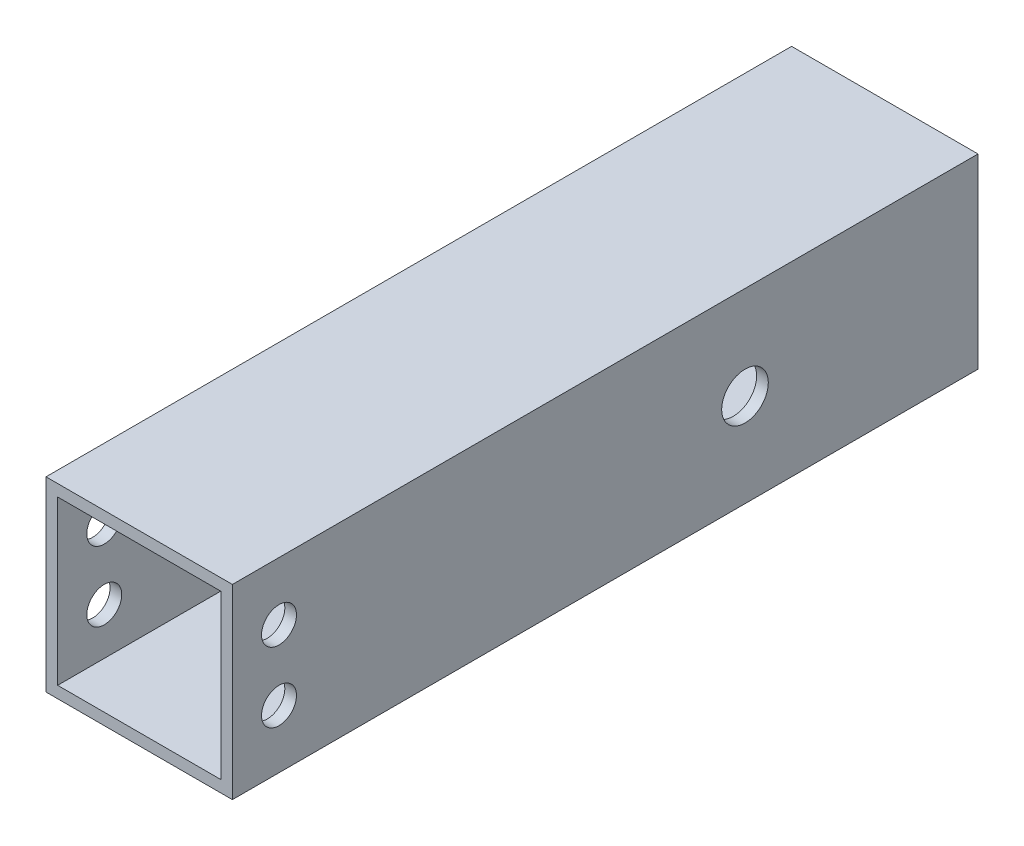
ISO-10303-21;
HEADER;
FILE_DESCRIPTION(('STEP AP214'),'2;1');
FILE_NAME('part.step','',(''),(''),'','','');
FILE_SCHEMA(('AUTOMOTIVE_DESIGN { 1 0 10303 214 1 1 1 1 }'));
ENDSEC;
DATA;
#1=APPLICATION_CONTEXT('core data for automotive mechanical design processes');
#2=APPLICATION_PROTOCOL_DEFINITION('international standard','automotive_design',2000,#1);
#3=PRODUCT_CONTEXT('',#1,'mechanical');
#4=PRODUCT('Part','Part','',(#3));
#5=PRODUCT_RELATED_PRODUCT_CATEGORY('part','',(#4));
#6=PRODUCT_DEFINITION_FORMATION('','',#4);
#7=PRODUCT_DEFINITION_CONTEXT('part definition',#1,'design');
#8=PRODUCT_DEFINITION('design','',#6,#7);
#9=PRODUCT_DEFINITION_SHAPE('','',#8);
#10=(LENGTH_UNIT() NAMED_UNIT(*) SI_UNIT(.MILLI.,.METRE.));
#11=(NAMED_UNIT(*) PLANE_ANGLE_UNIT() SI_UNIT($,.RADIAN.));
#12=(NAMED_UNIT(*) SI_UNIT($,.STERADIAN.) SOLID_ANGLE_UNIT());
#13=UNCERTAINTY_MEASURE_WITH_UNIT(LENGTH_MEASURE(1.E-05),#10,'distance_accuracy_value','');
#14=(GEOMETRIC_REPRESENTATION_CONTEXT(3) GLOBAL_UNCERTAINTY_ASSIGNED_CONTEXT((#13)) GLOBAL_UNIT_ASSIGNED_CONTEXT((#10,
#11,#12)) REPRESENTATION_CONTEXT('',''));
#15=CARTESIAN_POINT('',(0.,0.,0.));
#16=DIRECTION('',(0.,0.,1.));
#17=DIRECTION('',(1.,0.,0.));
#18=AXIS2_PLACEMENT_3D('',#15,#16,#17);
#19=CARTESIAN_POINT('',(0.,0.,101.6));
#20=DIRECTION('',(0.,0.,-1.));
#21=DIRECTION('',(-1.,0.,0.));
#22=AXIS2_PLACEMENT_3D('',#19,#20,#21);
#23=PLANE('',#22);
#24=DIRECTION('',(0.,1.,0.));
#25=VECTOR('',#24,1.);
#26=CARTESIAN_POINT('',(12.7,-12.7,101.6));
#27=LINE('',#26,#25);
#28=CARTESIAN_POINT('',(12.7,-12.7,101.6));
#29=VERTEX_POINT('',#28);
#30=CARTESIAN_POINT('',(12.7,12.7,101.6));
#31=VERTEX_POINT('',#30);
#32=EDGE_CURVE('E141',#29,#31,#27,.T.);
#33=ORIENTED_EDGE('',*,*,#32,.T.);
#34=DIRECTION('',(-1.,0.,0.));
#35=VECTOR('',#34,1.);
#36=CARTESIAN_POINT('',(-12.7,12.7,101.6));
#37=LINE('',#36,#35);
#38=CARTESIAN_POINT('',(-12.7,12.7,101.6));
#39=VERTEX_POINT('',#38);
#40=EDGE_CURVE('E144',#31,#39,#37,.T.);
#41=ORIENTED_EDGE('',*,*,#40,.T.);
#42=DIRECTION('',(0.,-1.,0.));
#43=VECTOR('',#42,1.);
#44=CARTESIAN_POINT('',(-12.7,-12.7,101.6));
#45=LINE('',#44,#43);
#46=CARTESIAN_POINT('',(-12.7,-12.7,101.6));
#47=VERTEX_POINT('',#46);
#48=EDGE_CURVE('E147',#39,#47,#45,.T.);
#49=ORIENTED_EDGE('',*,*,#48,.T.);
#50=DIRECTION('',(1.,0.,0.));
#51=VECTOR('',#50,1.);
#52=CARTESIAN_POINT('',(-12.7,-12.7,101.6));
#53=LINE('',#52,#51);
#54=EDGE_CURVE('E149',#47,#29,#53,.T.);
#55=ORIENTED_EDGE('',*,*,#54,.T.);
#56=EDGE_LOOP('',(#33,#41,#49,#55));
#57=FACE_BOUND('',#56,.T.);
#58=DIRECTION('',(0.,1.,0.));
#59=VECTOR('',#58,1.);
#60=CARTESIAN_POINT('',(11.1125,-11.1125,101.6));
#61=LINE('',#60,#59);
#62=CARTESIAN_POINT('',(11.1125,-11.1125,101.6));
#63=VERTEX_POINT('',#62);
#64=CARTESIAN_POINT('',(11.1125,11.1125,101.6));
#65=VERTEX_POINT('',#64);
#66=EDGE_CURVE('E103',#63,#65,#61,.T.);
#67=ORIENTED_EDGE('',*,*,#66,.F.);
#68=DIRECTION('',(1.,0.,0.));
#69=VECTOR('',#68,1.);
#70=CARTESIAN_POINT('',(-11.1125,-11.1125,101.6));
#71=LINE('',#70,#69);
#72=CARTESIAN_POINT('',(-11.1125,-11.1125,101.6));
#73=VERTEX_POINT('',#72);
#74=EDGE_CURVE('E125',#73,#63,#71,.T.);
#75=ORIENTED_EDGE('',*,*,#74,.F.);
#76=DIRECTION('',(0.,-1.,0.));
#77=VECTOR('',#76,1.);
#78=CARTESIAN_POINT('',(-11.1125,-11.1125,101.6));
#79=LINE('',#78,#77);
#80=CARTESIAN_POINT('',(-11.1125,11.1125,101.6));
#81=VERTEX_POINT('',#80);
#82=EDGE_CURVE('E123',#81,#73,#79,.T.);
#83=ORIENTED_EDGE('',*,*,#82,.F.);
#84=DIRECTION('',(-1.,0.,0.));
#85=VECTOR('',#84,1.);
#86=CARTESIAN_POINT('',(-11.1125,11.1125,101.6));
#87=LINE('',#86,#85);
#88=EDGE_CURVE('E111',#65,#81,#87,.T.);
#89=ORIENTED_EDGE('',*,*,#88,.F.);
#90=EDGE_LOOP('',(#67,#75,#83,#89));
#91=FACE_BOUND('',#90,.T.);
#92=ADVANCED_FACE('F36',(#57,#91),#23,.F.);
#93=CARTESIAN_POINT('',(0.,0.,0.));
#94=DIRECTION('',(0.,0.,-1.));
#95=DIRECTION('',(-1.,0.,0.));
#96=AXIS2_PLACEMENT_3D('',#93,#94,#95);
#97=PLANE('',#96);
#98=DIRECTION('',(0.,1.,0.));
#99=VECTOR('',#98,1.);
#100=CARTESIAN_POINT('',(12.7,-12.7,0.));
#101=LINE('',#100,#99);
#102=CARTESIAN_POINT('',(12.7,-12.7,0.));
#103=VERTEX_POINT('',#102);
#104=CARTESIAN_POINT('',(12.7,12.7,0.));
#105=VERTEX_POINT('',#104);
#106=EDGE_CURVE('E119',#103,#105,#101,.T.);
#107=ORIENTED_EDGE('',*,*,#106,.F.);
#108=DIRECTION('',(1.,0.,0.));
#109=VECTOR('',#108,1.);
#110=CARTESIAN_POINT('',(-12.7,-12.7,0.));
#111=LINE('',#110,#109);
#112=CARTESIAN_POINT('',(-12.7,-12.7,0.));
#113=VERTEX_POINT('',#112);
#114=EDGE_CURVE('E145',#113,#103,#111,.T.);
#115=ORIENTED_EDGE('',*,*,#114,.F.);
#116=DIRECTION('',(0.,-1.,0.));
#117=VECTOR('',#116,1.);
#118=CARTESIAN_POINT('',(-12.7,-12.7,0.));
#119=LINE('',#118,#117);
#120=CARTESIAN_POINT('',(-12.7,12.7,0.));
#121=VERTEX_POINT('',#120);
#122=EDGE_CURVE('E156',#121,#113,#119,.T.);
#123=ORIENTED_EDGE('',*,*,#122,.F.);
#124=DIRECTION('',(-1.,0.,0.));
#125=VECTOR('',#124,1.);
#126=CARTESIAN_POINT('',(-12.7,12.7,0.));
#127=LINE('',#126,#125);
#128=EDGE_CURVE('E154',#105,#121,#127,.T.);
#129=ORIENTED_EDGE('',*,*,#128,.F.);
#130=EDGE_LOOP('',(#107,#115,#123,#129));
#131=FACE_BOUND('',#130,.T.);
#132=DIRECTION('',(1.,0.,0.));
#133=VECTOR('',#132,1.);
#134=CARTESIAN_POINT('',(-11.1125,-11.1125,0.));
#135=LINE('',#134,#133);
#136=CARTESIAN_POINT('',(-11.1125,-11.1125,0.));
#137=VERTEX_POINT('',#136);
#138=CARTESIAN_POINT('',(11.1125,-11.1125,0.));
#139=VERTEX_POINT('',#138);
#140=EDGE_CURVE('E112',#137,#139,#135,.T.);
#141=ORIENTED_EDGE('',*,*,#140,.T.);
#142=DIRECTION('',(0.,1.,0.));
#143=VECTOR('',#142,1.);
#144=CARTESIAN_POINT('',(11.1125,-11.1125,0.));
#145=LINE('',#144,#143);
#146=CARTESIAN_POINT('',(11.1125,11.1125,0.));
#147=VERTEX_POINT('',#146);
#148=EDGE_CURVE('E61',#139,#147,#145,.T.);
#149=ORIENTED_EDGE('',*,*,#148,.T.);
#150=DIRECTION('',(-1.,0.,0.));
#151=VECTOR('',#150,1.);
#152=CARTESIAN_POINT('',(-11.1125,11.1125,0.));
#153=LINE('',#152,#151);
#154=CARTESIAN_POINT('',(-11.1125,11.1125,0.));
#155=VERTEX_POINT('',#154);
#156=EDGE_CURVE('E118',#147,#155,#153,.T.);
#157=ORIENTED_EDGE('',*,*,#156,.T.);
#158=DIRECTION('',(0.,-1.,0.));
#159=VECTOR('',#158,1.);
#160=CARTESIAN_POINT('',(-11.1125,-11.1125,0.));
#161=LINE('',#160,#159);
#162=EDGE_CURVE('E133',#155,#137,#161,.T.);
#163=ORIENTED_EDGE('',*,*,#162,.T.);
#164=EDGE_LOOP('',(#141,#149,#157,#163));
#165=FACE_BOUND('',#164,.T.);
#166=ADVANCED_FACE('F202',(#131,#165),#97,.T.);
#167=CARTESIAN_POINT('',(12.7,-12.7,101.6));
#168=DIRECTION('',(-1.,0.,0.));
#169=DIRECTION('',(0.,0.,1.));
#170=AXIS2_PLACEMENT_3D('',#167,#168,#169);
#171=PLANE('',#170);
#172=CARTESIAN_POINT('',(12.7,0.,31.75));
#173=DIRECTION('',(1.,0.,0.));
#174=DIRECTION('',(0.,0.,-1.));
#175=AXIS2_PLACEMENT_3D('',#172,#173,#174);
#176=CIRCLE('',#175,3.175);
#177=CARTESIAN_POINT('',(12.7,0.,28.575));
#178=VERTEX_POINT('',#177);
#179=EDGE_CURVE('E255',#178,#178,#176,.T.);
#180=ORIENTED_EDGE('',*,*,#179,.F.);
#181=EDGE_LOOP('',(#180));
#182=FACE_BOUND('',#181,.T.);
#183=CARTESIAN_POINT('',(12.7,-4.7625,95.25));
#184=DIRECTION('',(1.,0.,0.));
#185=DIRECTION('',(0.,0.,-1.));
#186=AXIS2_PLACEMENT_3D('',#183,#184,#185);
#187=CIRCLE('',#186,2.38125000000001);
#188=CARTESIAN_POINT('',(12.7,-4.7625,92.86875));
#189=VERTEX_POINT('',#188);
#190=EDGE_CURVE('E259',#189,#189,#187,.T.);
#191=ORIENTED_EDGE('',*,*,#190,.F.);
#192=EDGE_LOOP('',(#191));
#193=FACE_BOUND('',#192,.T.);
#194=CARTESIAN_POINT('',(12.7,4.7625,95.25));
#195=DIRECTION('',(1.,0.,0.));
#196=DIRECTION('',(0.,0.,-1.));
#197=AXIS2_PLACEMENT_3D('',#194,#195,#196);
#198=CIRCLE('',#197,2.38125000000001);
#199=CARTESIAN_POINT('',(12.7,4.7625,92.86875));
#200=VERTEX_POINT('',#199);
#201=EDGE_CURVE('E262',#200,#200,#198,.T.);
#202=ORIENTED_EDGE('',*,*,#201,.F.);
#203=EDGE_LOOP('',(#202));
#204=FACE_BOUND('',#203,.T.);
#205=ORIENTED_EDGE('',*,*,#106,.T.);
#206=DIRECTION('',(0.,0.,-1.));
#207=VECTOR('',#206,1.);
#208=CARTESIAN_POINT('',(12.7,12.7,101.6));
#209=LINE('',#208,#207);
#210=EDGE_CURVE('E11',#31,#105,#209,.T.);
#211=ORIENTED_EDGE('',*,*,#210,.F.);
#212=ORIENTED_EDGE('',*,*,#32,.F.);
#213=DIRECTION('',(0.,0.,-1.));
#214=VECTOR('',#213,1.);
#215=CARTESIAN_POINT('',(12.7,-12.7,101.6));
#216=LINE('',#215,#214);
#217=EDGE_CURVE('E151',#29,#103,#216,.T.);
#218=ORIENTED_EDGE('',*,*,#217,.T.);
#219=EDGE_LOOP('',(#205,#211,#212,#218));
#220=FACE_BOUND('',#219,.T.);
#221=ADVANCED_FACE('F38',(#182,#193,#204,#220),#171,.F.);
#222=CARTESIAN_POINT('',(-12.7,12.7,101.6));
#223=DIRECTION('',(0.,-1.,0.));
#224=DIRECTION('',(0.,0.,-1.));
#225=AXIS2_PLACEMENT_3D('',#222,#223,#224);
#226=PLANE('',#225);
#227=ORIENTED_EDGE('',*,*,#128,.T.);
#228=DIRECTION('',(0.,0.,-1.));
#229=VECTOR('',#228,1.);
#230=CARTESIAN_POINT('',(-12.7,12.7,101.6));
#231=LINE('',#230,#229);
#232=EDGE_CURVE('E45',#39,#121,#231,.T.);
#233=ORIENTED_EDGE('',*,*,#232,.F.);
#234=ORIENTED_EDGE('',*,*,#40,.F.);
#235=ORIENTED_EDGE('',*,*,#210,.T.);
#236=EDGE_LOOP('',(#227,#233,#234,#235));
#237=FACE_BOUND('',#236,.T.);
#238=ADVANCED_FACE('F230',(#237),#226,.F.);
#239=CARTESIAN_POINT('',(-12.7,-12.7,101.6));
#240=DIRECTION('',(1.,0.,0.));
#241=DIRECTION('',(0.,0.,-1.));
#242=AXIS2_PLACEMENT_3D('',#239,#240,#241);
#243=PLANE('',#242);
#244=CARTESIAN_POINT('',(-12.7,0.,31.75));
#245=DIRECTION('',(1.,0.,0.));
#246=DIRECTION('',(0.,0.,-1.));
#247=AXIS2_PLACEMENT_3D('',#244,#245,#246);
#248=CIRCLE('',#247,3.175);
#249=CARTESIAN_POINT('',(-12.7,0.,28.575));
#250=VERTEX_POINT('',#249);
#251=EDGE_CURVE('E269',#250,#250,#248,.F.);
#252=ORIENTED_EDGE('',*,*,#251,.F.);
#253=EDGE_LOOP('',(#252));
#254=FACE_BOUND('',#253,.T.);
#255=CARTESIAN_POINT('',(-12.7,-4.7625,95.25));
#256=DIRECTION('',(1.,0.,0.));
#257=DIRECTION('',(0.,0.,-1.));
#258=AXIS2_PLACEMENT_3D('',#255,#256,#257);
#259=CIRCLE('',#258,2.38125000000001);
#260=CARTESIAN_POINT('',(-12.7,-4.7625,92.86875));
#261=VERTEX_POINT('',#260);
#262=EDGE_CURVE('E264',#261,#261,#259,.F.);
#263=ORIENTED_EDGE('',*,*,#262,.F.);
#264=EDGE_LOOP('',(#263));
#265=FACE_BOUND('',#264,.T.);
#266=CARTESIAN_POINT('',(-12.7,4.7625,95.25));
#267=DIRECTION('',(1.,0.,0.));
#268=DIRECTION('',(0.,0.,-1.));
#269=AXIS2_PLACEMENT_3D('',#266,#267,#268);
#270=CIRCLE('',#269,2.38125000000001);
#271=CARTESIAN_POINT('',(-12.7,4.7625,92.86875));
#272=VERTEX_POINT('',#271);
#273=EDGE_CURVE('E169',#272,#272,#270,.F.);
#274=ORIENTED_EDGE('',*,*,#273,.F.);
#275=EDGE_LOOP('',(#274));
#276=FACE_BOUND('',#275,.T.);
#277=ORIENTED_EDGE('',*,*,#122,.T.);
#278=DIRECTION('',(0.,0.,-1.));
#279=VECTOR('',#278,1.);
#280=CARTESIAN_POINT('',(-12.7,-12.7,101.6));
#281=LINE('',#280,#279);
#282=EDGE_CURVE('E161',#47,#113,#281,.T.);
#283=ORIENTED_EDGE('',*,*,#282,.F.);
#284=ORIENTED_EDGE('',*,*,#48,.F.);
#285=ORIENTED_EDGE('',*,*,#232,.T.);
#286=EDGE_LOOP('',(#277,#283,#284,#285));
#287=FACE_BOUND('',#286,.T.);
#288=ADVANCED_FACE('F227',(#254,#265,#276,#287),#243,.F.);
#289=CARTESIAN_POINT('',(-12.7,-12.7,101.6));
#290=DIRECTION('',(0.,1.,0.));
#291=DIRECTION('',(0.,0.,1.));
#292=AXIS2_PLACEMENT_3D('',#289,#290,#291);
#293=PLANE('',#292);
#294=ORIENTED_EDGE('',*,*,#114,.T.);
#295=ORIENTED_EDGE('',*,*,#217,.F.);
#296=ORIENTED_EDGE('',*,*,#54,.F.);
#297=ORIENTED_EDGE('',*,*,#282,.T.);
#298=EDGE_LOOP('',(#294,#295,#296,#297));
#299=FACE_BOUND('',#298,.T.);
#300=ADVANCED_FACE('F224',(#299),#293,.F.);
#301=CARTESIAN_POINT('',(11.1125,-11.1125,101.6));
#302=DIRECTION('',(-1.,0.,0.));
#303=DIRECTION('',(0.,0.,1.));
#304=AXIS2_PLACEMENT_3D('',#301,#302,#303);
#305=PLANE('',#304);
#306=CARTESIAN_POINT('',(11.1125,0.,31.75));
#307=DIRECTION('',(-1.,0.,0.));
#308=DIRECTION('',(0.,0.,1.));
#309=AXIS2_PLACEMENT_3D('',#306,#307,#308);
#310=CIRCLE('',#309,3.175);
#311=CARTESIAN_POINT('',(11.1125,0.,34.925));
#312=VERTEX_POINT('',#311);
#313=EDGE_CURVE('E131',#312,#312,#310,.T.);
#314=ORIENTED_EDGE('',*,*,#313,.F.);
#315=EDGE_LOOP('',(#314));
#316=FACE_BOUND('',#315,.T.);
#317=CARTESIAN_POINT('',(11.1125,-4.7625,95.25));
#318=DIRECTION('',(-1.,0.,0.));
#319=DIRECTION('',(0.,0.,1.));
#320=AXIS2_PLACEMENT_3D('',#317,#318,#319);
#321=CIRCLE('',#320,2.38125000000001);
#322=CARTESIAN_POINT('',(11.1125,-4.7625,97.63125));
#323=VERTEX_POINT('',#322);
#324=EDGE_CURVE('E172',#323,#323,#321,.T.);
#325=ORIENTED_EDGE('',*,*,#324,.F.);
#326=EDGE_LOOP('',(#325));
#327=FACE_BOUND('',#326,.T.);
#328=CARTESIAN_POINT('',(11.1125,4.7625,95.25));
#329=DIRECTION('',(-1.,0.,0.));
#330=DIRECTION('',(0.,0.,1.));
#331=AXIS2_PLACEMENT_3D('',#328,#329,#330);
#332=CIRCLE('',#331,2.38125000000001);
#333=CARTESIAN_POINT('',(11.1125,4.7625,97.63125));
#334=VERTEX_POINT('',#333);
#335=EDGE_CURVE('E168',#334,#334,#332,.T.);
#336=ORIENTED_EDGE('',*,*,#335,.F.);
#337=EDGE_LOOP('',(#336));
#338=FACE_BOUND('',#337,.T.);
#339=ORIENTED_EDGE('',*,*,#148,.F.);
#340=DIRECTION('',(0.,0.,-1.));
#341=VECTOR('',#340,1.);
#342=CARTESIAN_POINT('',(11.1125,-11.1125,101.6));
#343=LINE('',#342,#341);
#344=EDGE_CURVE('E107',#63,#139,#343,.T.);
#345=ORIENTED_EDGE('',*,*,#344,.F.);
#346=ORIENTED_EDGE('',*,*,#66,.T.);
#347=DIRECTION('',(0.,0.,-1.));
#348=VECTOR('',#347,1.);
#349=CARTESIAN_POINT('',(11.1125,11.1125,101.6));
#350=LINE('',#349,#348);
#351=EDGE_CURVE('E106',#65,#147,#350,.T.);
#352=ORIENTED_EDGE('',*,*,#351,.T.);
#353=EDGE_LOOP('',(#339,#345,#346,#352));
#354=FACE_BOUND('',#353,.T.);
#355=ADVANCED_FACE('F105',(#316,#327,#338,#354),#305,.T.);
#356=CARTESIAN_POINT('',(-11.1125,11.1125,101.6));
#357=DIRECTION('',(0.,-1.,0.));
#358=DIRECTION('',(0.,0.,-1.));
#359=AXIS2_PLACEMENT_3D('',#356,#357,#358);
#360=PLANE('',#359);
#361=ORIENTED_EDGE('',*,*,#156,.F.);
#362=ORIENTED_EDGE('',*,*,#351,.F.);
#363=ORIENTED_EDGE('',*,*,#88,.T.);
#364=DIRECTION('',(0.,0.,-1.));
#365=VECTOR('',#364,1.);
#366=CARTESIAN_POINT('',(-11.1125,11.1125,101.6));
#367=LINE('',#366,#365);
#368=EDGE_CURVE('E120',#81,#155,#367,.T.);
#369=ORIENTED_EDGE('',*,*,#368,.T.);
#370=EDGE_LOOP('',(#361,#362,#363,#369));
#371=FACE_BOUND('',#370,.T.);
#372=ADVANCED_FACE('F115',(#371),#360,.T.);
#373=CARTESIAN_POINT('',(-11.1125,-11.1125,101.6));
#374=DIRECTION('',(1.,0.,0.));
#375=DIRECTION('',(0.,0.,-1.));
#376=AXIS2_PLACEMENT_3D('',#373,#374,#375);
#377=PLANE('',#376);
#378=CARTESIAN_POINT('',(-11.1125,0.,31.75));
#379=DIRECTION('',(1.,0.,0.));
#380=DIRECTION('',(0.,0.,-1.));
#381=AXIS2_PLACEMENT_3D('',#378,#379,#380);
#382=CIRCLE('',#381,3.175);
#383=CARTESIAN_POINT('',(-11.1125,0.,28.575));
#384=VERTEX_POINT('',#383);
#385=EDGE_CURVE('E40',#384,#384,#382,.T.);
#386=ORIENTED_EDGE('',*,*,#385,.F.);
#387=EDGE_LOOP('',(#386));
#388=FACE_BOUND('',#387,.T.);
#389=CARTESIAN_POINT('',(-11.1125,-4.7625,95.25));
#390=DIRECTION('',(1.,0.,0.));
#391=DIRECTION('',(0.,0.,-1.));
#392=AXIS2_PLACEMENT_3D('',#389,#390,#391);
#393=CIRCLE('',#392,2.38125000000001);
#394=CARTESIAN_POINT('',(-11.1125,-4.7625,92.86875));
#395=VERTEX_POINT('',#394);
#396=EDGE_CURVE('E170',#395,#395,#393,.T.);
#397=ORIENTED_EDGE('',*,*,#396,.F.);
#398=EDGE_LOOP('',(#397));
#399=FACE_BOUND('',#398,.T.);
#400=CARTESIAN_POINT('',(-11.1125,4.7625,95.25));
#401=DIRECTION('',(1.,0.,0.));
#402=DIRECTION('',(0.,0.,-1.));
#403=AXIS2_PLACEMENT_3D('',#400,#401,#402);
#404=CIRCLE('',#403,2.38125000000001);
#405=CARTESIAN_POINT('',(-11.1125,4.7625,92.86875));
#406=VERTEX_POINT('',#405);
#407=EDGE_CURVE('E166',#406,#406,#404,.T.);
#408=ORIENTED_EDGE('',*,*,#407,.F.);
#409=EDGE_LOOP('',(#408));
#410=FACE_BOUND('',#409,.T.);
#411=ORIENTED_EDGE('',*,*,#162,.F.);
#412=ORIENTED_EDGE('',*,*,#368,.F.);
#413=ORIENTED_EDGE('',*,*,#82,.T.);
#414=DIRECTION('',(0.,0.,-1.));
#415=VECTOR('',#414,1.);
#416=CARTESIAN_POINT('',(-11.1125,-11.1125,101.6));
#417=LINE('',#416,#415);
#418=EDGE_CURVE('E53',#73,#137,#417,.T.);
#419=ORIENTED_EDGE('',*,*,#418,.T.);
#420=EDGE_LOOP('',(#411,#412,#413,#419));
#421=FACE_BOUND('',#420,.T.);
#422=ADVANCED_FACE('F192',(#388,#399,#410,#421),#377,.T.);
#423=CARTESIAN_POINT('',(-11.1125,-11.1125,101.6));
#424=DIRECTION('',(0.,1.,0.));
#425=DIRECTION('',(0.,0.,1.));
#426=AXIS2_PLACEMENT_3D('',#423,#424,#425);
#427=PLANE('',#426);
#428=ORIENTED_EDGE('',*,*,#140,.F.);
#429=ORIENTED_EDGE('',*,*,#418,.F.);
#430=ORIENTED_EDGE('',*,*,#74,.T.);
#431=ORIENTED_EDGE('',*,*,#344,.T.);
#432=EDGE_LOOP('',(#428,#429,#430,#431));
#433=FACE_BOUND('',#432,.T.);
#434=ADVANCED_FACE('F195',(#433),#427,.T.);
#435=CARTESIAN_POINT('',(-21.6802561210691,4.7625,95.25));
#436=DIRECTION('',(1.,0.,0.));
#437=DIRECTION('',(0.,0.,-1.));
#438=AXIS2_PLACEMENT_3D('',#435,#436,#437);
#439=CYLINDRICAL_SURFACE('',#438,2.38125000000001);
#440=ORIENTED_EDGE('',*,*,#407,.T.);
#441=EDGE_LOOP('',(#440));
#442=FACE_BOUND('',#441,.T.);
#443=ORIENTED_EDGE('',*,*,#273,.T.);
#444=EDGE_LOOP('',(#443));
#445=FACE_BOUND('',#444,.T.);
#446=ADVANCED_FACE('F204',(#442,#445),#439,.F.);
#447=CARTESIAN_POINT('',(-21.6802561210691,-4.7625,95.25));
#448=DIRECTION('',(1.,0.,0.));
#449=DIRECTION('',(0.,0.,-1.));
#450=AXIS2_PLACEMENT_3D('',#447,#448,#449);
#451=CYLINDRICAL_SURFACE('',#450,2.38125000000001);
#452=ORIENTED_EDGE('',*,*,#396,.T.);
#453=EDGE_LOOP('',(#452));
#454=FACE_BOUND('',#453,.T.);
#455=ORIENTED_EDGE('',*,*,#262,.T.);
#456=EDGE_LOOP('',(#455));
#457=FACE_BOUND('',#456,.T.);
#458=ADVANCED_FACE('F209',(#454,#457),#451,.F.);
#459=CARTESIAN_POINT('',(-21.6802561210691,0.,31.75));
#460=DIRECTION('',(1.,0.,0.));
#461=DIRECTION('',(0.,0.,-1.));
#462=AXIS2_PLACEMENT_3D('',#459,#460,#461);
#463=CYLINDRICAL_SURFACE('',#462,3.175);
#464=ORIENTED_EDGE('',*,*,#385,.T.);
#465=EDGE_LOOP('',(#464));
#466=FACE_BOUND('',#465,.T.);
#467=ORIENTED_EDGE('',*,*,#251,.T.);
#468=EDGE_LOOP('',(#467));
#469=FACE_BOUND('',#468,.T.);
#470=ADVANCED_FACE('F189',(#466,#469),#463,.F.);
#471=ORIENTED_EDGE('',*,*,#335,.T.);
#472=EDGE_LOOP('',(#471));
#473=FACE_BOUND('',#472,.T.);
#474=ORIENTED_EDGE('',*,*,#201,.T.);
#475=EDGE_LOOP('',(#474));
#476=FACE_BOUND('',#475,.T.);
#477=ADVANCED_FACE('F212',(#473,#476),#439,.F.);
#478=ORIENTED_EDGE('',*,*,#324,.T.);
#479=EDGE_LOOP('',(#478));
#480=FACE_BOUND('',#479,.T.);
#481=ORIENTED_EDGE('',*,*,#190,.T.);
#482=EDGE_LOOP('',(#481));
#483=FACE_BOUND('',#482,.T.);
#484=ADVANCED_FACE('F274',(#480,#483),#451,.F.);
#485=ORIENTED_EDGE('',*,*,#313,.T.);
#486=EDGE_LOOP('',(#485));
#487=FACE_BOUND('',#486,.T.);
#488=ORIENTED_EDGE('',*,*,#179,.T.);
#489=EDGE_LOOP('',(#488));
#490=FACE_BOUND('',#489,.T.);
#491=ADVANCED_FACE('F276',(#487,#490),#463,.F.);
#492=CLOSED_SHELL('',(#92,#166,#221,#238,#288,#300,#355,#372,#422,#434,#446,#458,#470,#477,#484,#491));
#493=MANIFOLD_SOLID_BREP('B2',#492);
#494=ADVANCED_BREP_SHAPE_REPRESENTATION('',(#18,#493),#14);
#495=SHAPE_DEFINITION_REPRESENTATION(#9,#494);
ENDSEC;
END-ISO-10303-21;
